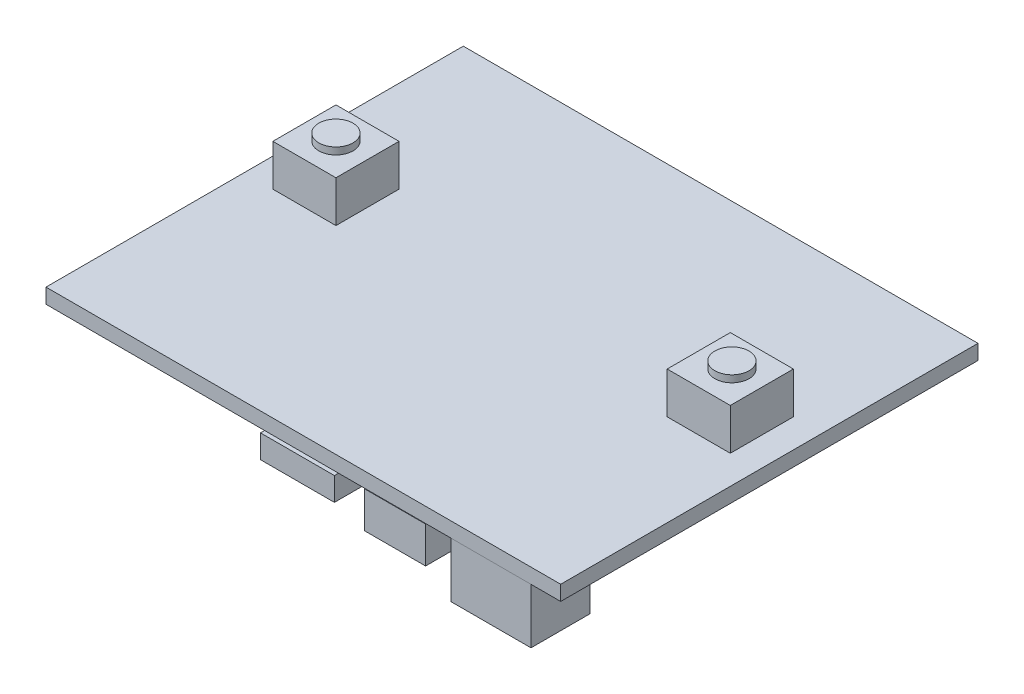
ISO-10303-21;
HEADER;
FILE_DESCRIPTION(('STEP AP214'),'2;1');
FILE_NAME('part.step','',(''),(''),'','','');
FILE_SCHEMA(('AUTOMOTIVE_DESIGN { 1 0 10303 214 1 1 1 1 }'));
ENDSEC;
DATA;
#1=APPLICATION_CONTEXT('core data for automotive mechanical design processes');
#2=APPLICATION_PROTOCOL_DEFINITION('international standard','automotive_design',2000,#1);
#3=PRODUCT_CONTEXT('',#1,'mechanical');
#4=PRODUCT('Part','Part','',(#3));
#5=PRODUCT_RELATED_PRODUCT_CATEGORY('part','',(#4));
#6=PRODUCT_DEFINITION_FORMATION('','',#4);
#7=PRODUCT_DEFINITION_CONTEXT('part definition',#1,'design');
#8=PRODUCT_DEFINITION('design','',#6,#7);
#9=PRODUCT_DEFINITION_SHAPE('','',#8);
#10=(LENGTH_UNIT() NAMED_UNIT(*) SI_UNIT(.MILLI.,.METRE.));
#11=(NAMED_UNIT(*) PLANE_ANGLE_UNIT() SI_UNIT($,.RADIAN.));
#12=(NAMED_UNIT(*) SI_UNIT($,.STERADIAN.) SOLID_ANGLE_UNIT());
#13=UNCERTAINTY_MEASURE_WITH_UNIT(LENGTH_MEASURE(1.E-05),#10,'distance_accuracy_value','');
#14=(GEOMETRIC_REPRESENTATION_CONTEXT(3) GLOBAL_UNCERTAINTY_ASSIGNED_CONTEXT((#13)) GLOBAL_UNIT_ASSIGNED_CONTEXT((#10,
#11,#12)) REPRESENTATION_CONTEXT('',''));
#15=CARTESIAN_POINT('',(0.,0.,0.));
#16=DIRECTION('',(0.,0.,1.));
#17=DIRECTION('',(1.,0.,0.));
#18=AXIS2_PLACEMENT_3D('',#15,#16,#17);
#19=CARTESIAN_POINT('',(0.,-1.5,0.));
#20=DIRECTION('',(0.,1.,0.));
#21=DIRECTION('',(0.,0.,1.));
#22=AXIS2_PLACEMENT_3D('',#19,#20,#21);
#23=PLANE('',#22);
#24=DIRECTION('',(0.,0.,-1.));
#25=VECTOR('',#24,1.);
#26=CARTESIAN_POINT('',(22.,-1.5,0.413325719228903));
#27=LINE('',#26,#25);
#28=CARTESIAN_POINT('',(22.,-1.5,0.));
#29=VERTEX_POINT('',#28);
#30=CARTESIAN_POINT('',(22.,-1.5,-5.4866742807711));
#31=VERTEX_POINT('',#30);
#32=EDGE_CURVE('E235',#29,#31,#27,.T.);
#33=ORIENTED_EDGE('',*,*,#32,.F.);
#34=DIRECTION('',(1.,0.,0.));
#35=VECTOR('',#34,1.);
#36=CARTESIAN_POINT('',(0.,-1.5,0.));
#37=LINE('',#36,#35);
#38=CARTESIAN_POINT('',(0.,-1.5,0.));
#39=VERTEX_POINT('',#38);
#40=EDGE_CURVE('E377',#39,#29,#37,.T.);
#41=ORIENTED_EDGE('',*,*,#40,.F.);
#42=DIRECTION('',(0.,0.,-1.));
#43=VECTOR('',#42,1.);
#44=CARTESIAN_POINT('',(0.,-1.5,0.));
#45=LINE('',#44,#43);
#46=CARTESIAN_POINT('',(0.,-1.5,-42.));
#47=VERTEX_POINT('',#46);
#48=EDGE_CURVE('E388',#39,#47,#45,.T.);
#49=ORIENTED_EDGE('',*,*,#48,.T.);
#50=DIRECTION('',(1.,0.,0.));
#51=VECTOR('',#50,1.);
#52=CARTESIAN_POINT('',(0.,-1.5,-42.));
#53=LINE('',#52,#51);
#54=CARTESIAN_POINT('',(51.8,-1.5,-42.));
#55=VERTEX_POINT('',#54);
#56=EDGE_CURVE('E386',#47,#55,#53,.T.);
#57=ORIENTED_EDGE('',*,*,#56,.T.);
#58=DIRECTION('',(0.,0.,-1.));
#59=VECTOR('',#58,1.);
#60=CARTESIAN_POINT('',(51.8,-1.5,0.));
#61=LINE('',#60,#59);
#62=CARTESIAN_POINT('',(51.8,-1.5,0.));
#63=VERTEX_POINT('',#62);
#64=EDGE_CURVE('E380',#63,#55,#61,.T.);
#65=ORIENTED_EDGE('',*,*,#64,.F.);
#66=CARTESIAN_POINT('',(38.2546903246862,-1.5,0.));
#67=VERTEX_POINT('',#66);
#68=EDGE_CURVE('E400',#67,#63,#37,.T.);
#69=ORIENTED_EDGE('',*,*,#68,.F.);
#70=DIRECTION('',(0.,0.,1.));
#71=VECTOR('',#70,1.);
#72=CARTESIAN_POINT('',(38.2546903246862,-1.5,-6.10873506961859));
#73=LINE('',#72,#71);
#74=CARTESIAN_POINT('',(38.2546903246862,-1.5,-6.10873506961859));
#75=VERTEX_POINT('',#74);
#76=EDGE_CURVE('E290',#75,#67,#73,.T.);
#77=ORIENTED_EDGE('',*,*,#76,.F.);
#78=DIRECTION('',(1.,0.,0.));
#79=VECTOR('',#78,1.);
#80=CARTESIAN_POINT('',(32.0946903246862,-1.5,-6.10873506961859));
#81=LINE('',#80,#79);
#82=CARTESIAN_POINT('',(32.0946903246862,-1.5,-6.10873506961859));
#83=VERTEX_POINT('',#82);
#84=EDGE_CURVE('E286',#83,#75,#81,.T.);
#85=ORIENTED_EDGE('',*,*,#84,.F.);
#86=DIRECTION('',(0.,0.,-1.));
#87=VECTOR('',#86,1.);
#88=CARTESIAN_POINT('',(32.0946903246862,-1.5,-6.10873506961859));
#89=LINE('',#88,#87);
#90=CARTESIAN_POINT('',(32.0946903246862,-1.5,0.));
#91=VERTEX_POINT('',#90);
#92=EDGE_CURVE('E48',#91,#83,#89,.T.);
#93=ORIENTED_EDGE('',*,*,#92,.F.);
#94=CARTESIAN_POINT('',(29.44,-1.5,0.));
#95=VERTEX_POINT('',#94);
#96=EDGE_CURVE('E382',#95,#91,#37,.T.);
#97=ORIENTED_EDGE('',*,*,#96,.F.);
#98=DIRECTION('',(0.,0.,1.));
#99=VECTOR('',#98,1.);
#100=CARTESIAN_POINT('',(29.44,-1.5,0.413325719228903));
#101=LINE('',#100,#99);
#102=CARTESIAN_POINT('',(29.44,-1.5,-5.4866742807711));
#103=VERTEX_POINT('',#102);
#104=EDGE_CURVE('E258',#103,#95,#101,.T.);
#105=ORIENTED_EDGE('',*,*,#104,.F.);
#106=DIRECTION('',(1.,0.,0.));
#107=VECTOR('',#106,1.);
#108=CARTESIAN_POINT('',(22.,-1.5,-5.4866742807711));
#109=LINE('',#108,#107);
#110=EDGE_CURVE('E255',#31,#103,#109,.T.);
#111=ORIENTED_EDGE('',*,*,#110,.F.);
#112=EDGE_LOOP('',(#33,#41,#49,#57,#65,#69,#77,#85,#93,#97,#105,#111));
#113=FACE_BOUND('',#112,.T.);
#114=DIRECTION('',(0.,0.,1.));
#115=VECTOR('',#114,1.);
#116=CARTESIAN_POINT('',(48.8,-1.5,-5.93123898902901));
#117=LINE('',#116,#115);
#118=CARTESIAN_POINT('',(48.8,-1.5,-5.93123898902901));
#119=VERTEX_POINT('',#118);
#120=CARTESIAN_POINT('',(48.8,-1.5,-0.0112389890290134));
#121=VERTEX_POINT('',#120);
#122=EDGE_CURVE('E234',#119,#121,#117,.T.);
#123=ORIENTED_EDGE('',*,*,#122,.F.);
#124=DIRECTION('',(1.,0.,0.));
#125=VECTOR('',#124,1.);
#126=CARTESIAN_POINT('',(48.8,-1.5,-5.93123898902901));
#127=LINE('',#126,#125);
#128=CARTESIAN_POINT('',(40.76,-1.5,-5.93123898902901));
#129=VERTEX_POINT('',#128);
#130=EDGE_CURVE('E231',#129,#119,#127,.T.);
#131=ORIENTED_EDGE('',*,*,#130,.F.);
#132=DIRECTION('',(0.,0.,-1.));
#133=VECTOR('',#132,1.);
#134=CARTESIAN_POINT('',(40.76,-1.5,-5.93123898902901));
#135=LINE('',#134,#133);
#136=CARTESIAN_POINT('',(40.76,-1.5,-0.0112389890290144));
#137=VERTEX_POINT('',#136);
#138=EDGE_CURVE('E61',#137,#129,#135,.T.);
#139=ORIENTED_EDGE('',*,*,#138,.F.);
#140=DIRECTION('',(-1.,0.,0.));
#141=VECTOR('',#140,1.);
#142=CARTESIAN_POINT('',(48.8,-1.5,-0.0112389890290134));
#143=LINE('',#142,#141);
#144=EDGE_CURVE('E56',#121,#137,#143,.T.);
#145=ORIENTED_EDGE('',*,*,#144,.F.);
#146=EDGE_LOOP('',(#123,#131,#139,#145));
#147=FACE_BOUND('',#146,.T.);
#148=ADVANCED_FACE('F39',(#113,#147),#23,.F.);
#149=CARTESIAN_POINT('',(0.,0.,0.));
#150=DIRECTION('',(0.,1.,0.));
#151=DIRECTION('',(0.,0.,1.));
#152=AXIS2_PLACEMENT_3D('',#149,#150,#151);
#153=PLANE('',#152);
#154=DIRECTION('',(1.,0.,0.));
#155=VECTOR('',#154,1.);
#156=CARTESIAN_POINT('',(0.,0.,0.));
#157=LINE('',#156,#155);
#158=CARTESIAN_POINT('',(0.,0.,0.));
#159=VERTEX_POINT('',#158);
#160=CARTESIAN_POINT('',(51.8,0.,0.));
#161=VERTEX_POINT('',#160);
#162=EDGE_CURVE('E349',#159,#161,#157,.T.);
#163=ORIENTED_EDGE('',*,*,#162,.T.);
#164=DIRECTION('',(0.,0.,-1.));
#165=VECTOR('',#164,1.);
#166=CARTESIAN_POINT('',(51.8,0.,0.));
#167=LINE('',#166,#165);
#168=CARTESIAN_POINT('',(51.8,0.,-42.));
#169=VERTEX_POINT('',#168);
#170=EDGE_CURVE('E392',#161,#169,#167,.T.);
#171=ORIENTED_EDGE('',*,*,#170,.T.);
#172=DIRECTION('',(1.,0.,0.));
#173=VECTOR('',#172,1.);
#174=CARTESIAN_POINT('',(0.,0.,-42.));
#175=LINE('',#174,#173);
#176=CARTESIAN_POINT('',(0.,0.,-42.));
#177=VERTEX_POINT('',#176);
#178=EDGE_CURVE('E395',#177,#169,#175,.T.);
#179=ORIENTED_EDGE('',*,*,#178,.F.);
#180=DIRECTION('',(0.,0.,-1.));
#181=VECTOR('',#180,1.);
#182=CARTESIAN_POINT('',(0.,0.,0.));
#183=LINE('',#182,#181);
#184=EDGE_CURVE('E398',#159,#177,#183,.T.);
#185=ORIENTED_EDGE('',*,*,#184,.F.);
#186=EDGE_LOOP('',(#163,#171,#179,#185));
#187=FACE_BOUND('',#186,.T.);
#188=DIRECTION('',(1.,0.,0.));
#189=VECTOR('',#188,1.);
#190=CARTESIAN_POINT('',(42.57,0.,-19.95));
#191=LINE('',#190,#189);
#192=CARTESIAN_POINT('',(42.57,0.,-19.95));
#193=VERTEX_POINT('',#192);
#194=CARTESIAN_POINT('',(48.92,0.,-19.95));
#195=VERTEX_POINT('',#194);
#196=EDGE_CURVE('E366',#193,#195,#191,.T.);
#197=ORIENTED_EDGE('',*,*,#196,.F.);
#198=DIRECTION('',(0.,0.,1.));
#199=VECTOR('',#198,1.);
#200=CARTESIAN_POINT('',(42.57,0.,-26.3));
#201=LINE('',#200,#199);
#202=CARTESIAN_POINT('',(42.57,0.,-26.3));
#203=VERTEX_POINT('',#202);
#204=EDGE_CURVE('E334',#203,#193,#201,.T.);
#205=ORIENTED_EDGE('',*,*,#204,.F.);
#206=DIRECTION('',(-1.,0.,0.));
#207=VECTOR('',#206,1.);
#208=CARTESIAN_POINT('',(42.57,0.,-26.3));
#209=LINE('',#208,#207);
#210=CARTESIAN_POINT('',(48.92,0.,-26.3));
#211=VERTEX_POINT('',#210);
#212=EDGE_CURVE('E360',#211,#203,#209,.T.);
#213=ORIENTED_EDGE('',*,*,#212,.F.);
#214=DIRECTION('',(0.,0.,-1.));
#215=VECTOR('',#214,1.);
#216=CARTESIAN_POINT('',(48.92,0.,-26.3));
#217=LINE('',#216,#215);
#218=EDGE_CURVE('E362',#195,#211,#217,.T.);
#219=ORIENTED_EDGE('',*,*,#218,.F.);
#220=EDGE_LOOP('',(#197,#205,#213,#219));
#221=FACE_BOUND('',#220,.T.);
#222=DIRECTION('',(1.,0.,0.));
#223=VECTOR('',#222,1.);
#224=CARTESIAN_POINT('',(2.88,0.,-19.95));
#225=LINE('',#224,#223);
#226=CARTESIAN_POINT('',(2.88,0.,-19.95));
#227=VERTEX_POINT('',#226);
#228=CARTESIAN_POINT('',(9.23,0.,-19.95));
#229=VERTEX_POINT('',#228);
#230=EDGE_CURVE('E333',#227,#229,#225,.T.);
#231=ORIENTED_EDGE('',*,*,#230,.F.);
#232=DIRECTION('',(0.,0.,1.));
#233=VECTOR('',#232,1.);
#234=CARTESIAN_POINT('',(2.88,0.,-26.3));
#235=LINE('',#234,#233);
#236=CARTESIAN_POINT('',(2.88,0.,-26.3));
#237=VERTEX_POINT('',#236);
#238=EDGE_CURVE('E330',#237,#227,#235,.T.);
#239=ORIENTED_EDGE('',*,*,#238,.F.);
#240=DIRECTION('',(-1.,0.,0.));
#241=VECTOR('',#240,1.);
#242=CARTESIAN_POINT('',(2.88,0.,-26.3));
#243=LINE('',#242,#241);
#244=CARTESIAN_POINT('',(9.23,0.,-26.3));
#245=VERTEX_POINT('',#244);
#246=EDGE_CURVE('E323',#245,#237,#243,.T.);
#247=ORIENTED_EDGE('',*,*,#246,.F.);
#248=DIRECTION('',(0.,0.,-1.));
#249=VECTOR('',#248,1.);
#250=CARTESIAN_POINT('',(9.23,0.,-26.3));
#251=LINE('',#250,#249);
#252=EDGE_CURVE('E336',#229,#245,#251,.T.);
#253=ORIENTED_EDGE('',*,*,#252,.F.);
#254=EDGE_LOOP('',(#231,#239,#247,#253));
#255=FACE_BOUND('',#254,.T.);
#256=ADVANCED_FACE('F417',(#187,#221,#255),#153,.T.);
#257=CARTESIAN_POINT('',(0.,-1.5,0.));
#258=DIRECTION('',(0.,0.,1.));
#259=DIRECTION('',(1.,0.,0.));
#260=AXIS2_PLACEMENT_3D('',#257,#258,#259);
#261=PLANE('',#260);
#262=ORIENTED_EDGE('',*,*,#162,.F.);
#263=DIRECTION('',(0.,1.,0.));
#264=VECTOR('',#263,1.);
#265=CARTESIAN_POINT('',(0.,-1.5,0.));
#266=LINE('',#265,#264);
#267=EDGE_CURVE('E314',#39,#159,#266,.T.);
#268=ORIENTED_EDGE('',*,*,#267,.F.);
#269=ORIENTED_EDGE('',*,*,#40,.T.);
#270=EDGE_CURVE('E381',#29,#95,#37,.T.);
#271=ORIENTED_EDGE('',*,*,#270,.T.);
#272=ORIENTED_EDGE('',*,*,#96,.T.);
#273=EDGE_CURVE('E383',#91,#67,#37,.T.);
#274=ORIENTED_EDGE('',*,*,#273,.T.);
#275=ORIENTED_EDGE('',*,*,#68,.T.);
#276=DIRECTION('',(0.,1.,0.));
#277=VECTOR('',#276,1.);
#278=CARTESIAN_POINT('',(51.8,-1.5,0.));
#279=LINE('',#278,#277);
#280=EDGE_CURVE('E43',#63,#161,#279,.T.);
#281=ORIENTED_EDGE('',*,*,#280,.T.);
#282=EDGE_LOOP('',(#262,#268,#269,#271,#272,#274,#275,#281));
#283=FACE_BOUND('',#282,.T.);
#284=ADVANCED_FACE('F41',(#283),#261,.T.);
#285=CARTESIAN_POINT('',(0.,-1.5,0.));
#286=DIRECTION('',(1.,0.,0.));
#287=DIRECTION('',(0.,0.,-1.));
#288=AXIS2_PLACEMENT_3D('',#285,#286,#287);
#289=PLANE('',#288);
#290=ORIENTED_EDGE('',*,*,#184,.T.);
#291=DIRECTION('',(0.,1.,0.));
#292=VECTOR('',#291,1.);
#293=CARTESIAN_POINT('',(0.,-1.5,-42.));
#294=LINE('',#293,#292);
#295=EDGE_CURVE('E402',#47,#177,#294,.T.);
#296=ORIENTED_EDGE('',*,*,#295,.F.);
#297=ORIENTED_EDGE('',*,*,#48,.F.);
#298=ORIENTED_EDGE('',*,*,#267,.T.);
#299=EDGE_LOOP('',(#290,#296,#297,#298));
#300=FACE_BOUND('',#299,.T.);
#301=ADVANCED_FACE('F421',(#300),#289,.F.);
#302=CARTESIAN_POINT('',(0.,-1.5,-42.));
#303=DIRECTION('',(0.,0.,1.));
#304=DIRECTION('',(1.,0.,0.));
#305=AXIS2_PLACEMENT_3D('',#302,#303,#304);
#306=PLANE('',#305);
#307=ORIENTED_EDGE('',*,*,#178,.T.);
#308=DIRECTION('',(0.,1.,0.));
#309=VECTOR('',#308,1.);
#310=CARTESIAN_POINT('',(51.8,-1.5,-42.));
#311=LINE('',#310,#309);
#312=EDGE_CURVE('E404',#55,#169,#311,.T.);
#313=ORIENTED_EDGE('',*,*,#312,.F.);
#314=ORIENTED_EDGE('',*,*,#56,.F.);
#315=ORIENTED_EDGE('',*,*,#295,.T.);
#316=EDGE_LOOP('',(#307,#313,#314,#315));
#317=FACE_BOUND('',#316,.T.);
#318=ADVANCED_FACE('F425',(#317),#306,.F.);
#319=CARTESIAN_POINT('',(51.8,-1.5,0.));
#320=DIRECTION('',(1.,0.,0.));
#321=DIRECTION('',(0.,0.,-1.));
#322=AXIS2_PLACEMENT_3D('',#319,#320,#321);
#323=PLANE('',#322);
#324=ORIENTED_EDGE('',*,*,#170,.F.);
#325=ORIENTED_EDGE('',*,*,#280,.F.);
#326=ORIENTED_EDGE('',*,*,#64,.T.);
#327=ORIENTED_EDGE('',*,*,#312,.T.);
#328=EDGE_LOOP('',(#324,#325,#326,#327));
#329=FACE_BOUND('',#328,.T.);
#330=ADVANCED_FACE('F413',(#329),#323,.T.);
#331=CARTESIAN_POINT('',(42.57,4.17,-26.3));
#332=DIRECTION('',(1.,0.,0.));
#333=DIRECTION('',(0.,0.,-1.));
#334=AXIS2_PLACEMENT_3D('',#331,#332,#333);
#335=PLANE('',#334);
#336=ORIENTED_EDGE('',*,*,#204,.T.);
#337=DIRECTION('',(0.,-1.,0.));
#338=VECTOR('',#337,1.);
#339=CARTESIAN_POINT('',(42.57,4.17,-19.95));
#340=LINE('',#339,#338);
#341=CARTESIAN_POINT('',(42.57,4.17,-19.95));
#342=VERTEX_POINT('',#341);
#343=EDGE_CURVE('E309',#342,#193,#340,.T.);
#344=ORIENTED_EDGE('',*,*,#343,.F.);
#345=DIRECTION('',(0.,0.,1.));
#346=VECTOR('',#345,1.);
#347=CARTESIAN_POINT('',(42.57,4.17,-26.3));
#348=LINE('',#347,#346);
#349=CARTESIAN_POINT('',(42.57,4.17,-26.3));
#350=VERTEX_POINT('',#349);
#351=EDGE_CURVE('E363',#350,#342,#348,.T.);
#352=ORIENTED_EDGE('',*,*,#351,.F.);
#353=DIRECTION('',(0.,-1.,0.));
#354=VECTOR('',#353,1.);
#355=CARTESIAN_POINT('',(42.57,4.17,-26.3));
#356=LINE('',#355,#354);
#357=EDGE_CURVE('E356',#350,#203,#356,.T.);
#358=ORIENTED_EDGE('',*,*,#357,.T.);
#359=EDGE_LOOP('',(#336,#344,#352,#358));
#360=FACE_BOUND('',#359,.T.);
#361=ADVANCED_FACE('F499',(#360),#335,.F.);
#362=CARTESIAN_POINT('',(42.57,4.17,-19.95));
#363=DIRECTION('',(0.,0.,-1.));
#364=DIRECTION('',(-1.,0.,0.));
#365=AXIS2_PLACEMENT_3D('',#362,#363,#364);
#366=PLANE('',#365);
#367=ORIENTED_EDGE('',*,*,#196,.T.);
#368=DIRECTION('',(0.,-1.,0.));
#369=VECTOR('',#368,1.);
#370=CARTESIAN_POINT('',(48.92,4.17,-19.95));
#371=LINE('',#370,#369);
#372=CARTESIAN_POINT('',(48.92,4.17,-19.95));
#373=VERTEX_POINT('',#372);
#374=EDGE_CURVE('E351',#373,#195,#371,.T.);
#375=ORIENTED_EDGE('',*,*,#374,.F.);
#376=DIRECTION('',(1.,0.,0.));
#377=VECTOR('',#376,1.);
#378=CARTESIAN_POINT('',(42.57,4.17,-19.95));
#379=LINE('',#378,#377);
#380=EDGE_CURVE('E373',#342,#373,#379,.T.);
#381=ORIENTED_EDGE('',*,*,#380,.F.);
#382=ORIENTED_EDGE('',*,*,#343,.T.);
#383=EDGE_LOOP('',(#367,#375,#381,#382));
#384=FACE_BOUND('',#383,.T.);
#385=ADVANCED_FACE('F503',(#384),#366,.F.);
#386=CARTESIAN_POINT('',(48.92,4.17,-26.3));
#387=DIRECTION('',(-1.,0.,0.));
#388=DIRECTION('',(0.,0.,1.));
#389=AXIS2_PLACEMENT_3D('',#386,#387,#388);
#390=PLANE('',#389);
#391=ORIENTED_EDGE('',*,*,#218,.T.);
#392=DIRECTION('',(0.,-1.,0.));
#393=VECTOR('',#392,1.);
#394=CARTESIAN_POINT('',(48.92,4.17,-26.3));
#395=LINE('',#394,#393);
#396=CARTESIAN_POINT('',(48.92,4.17,-26.3));
#397=VERTEX_POINT('',#396);
#398=EDGE_CURVE('E354',#397,#211,#395,.T.);
#399=ORIENTED_EDGE('',*,*,#398,.F.);
#400=DIRECTION('',(0.,0.,-1.));
#401=VECTOR('',#400,1.);
#402=CARTESIAN_POINT('',(48.92,4.17,-26.3));
#403=LINE('',#402,#401);
#404=EDGE_CURVE('E371',#373,#397,#403,.T.);
#405=ORIENTED_EDGE('',*,*,#404,.F.);
#406=ORIENTED_EDGE('',*,*,#374,.T.);
#407=EDGE_LOOP('',(#391,#399,#405,#406));
#408=FACE_BOUND('',#407,.T.);
#409=ADVANCED_FACE('F509',(#408),#390,.F.);
#410=CARTESIAN_POINT('',(42.57,4.17,-26.3));
#411=DIRECTION('',(0.,0.,1.));
#412=DIRECTION('',(1.,0.,0.));
#413=AXIS2_PLACEMENT_3D('',#410,#411,#412);
#414=PLANE('',#413);
#415=ORIENTED_EDGE('',*,*,#212,.T.);
#416=ORIENTED_EDGE('',*,*,#357,.F.);
#417=DIRECTION('',(-1.,0.,0.));
#418=VECTOR('',#417,1.);
#419=CARTESIAN_POINT('',(42.57,4.17,-26.3));
#420=LINE('',#419,#418);
#421=EDGE_CURVE('E359',#397,#350,#420,.T.);
#422=ORIENTED_EDGE('',*,*,#421,.F.);
#423=ORIENTED_EDGE('',*,*,#398,.T.);
#424=EDGE_LOOP('',(#415,#416,#422,#423));
#425=FACE_BOUND('',#424,.T.);
#426=ADVANCED_FACE('F517',(#425),#414,.F.);
#427=CARTESIAN_POINT('',(0.,4.17,0.));
#428=DIRECTION('',(0.,1.,0.));
#429=DIRECTION('',(0.,0.,1.));
#430=AXIS2_PLACEMENT_3D('',#427,#428,#429);
#431=PLANE('',#430);
#432=CARTESIAN_POINT('',(45.8170140740058,4.17,-23.2178731345387));
#433=DIRECTION('',(0.,1.,0.));
#434=DIRECTION('',(0.,0.,1.));
#435=AXIS2_PLACEMENT_3D('',#432,#433,#434);
#436=CIRCLE('',#435,1.72000000000001);
#437=CARTESIAN_POINT('',(45.8170140740058,4.17,-21.4978731345387));
#438=VERTEX_POINT('',#437);
#439=EDGE_CURVE('E313',#438,#438,#436,.T.);
#440=ORIENTED_EDGE('',*,*,#439,.F.);
#441=EDGE_LOOP('',(#440));
#442=FACE_BOUND('',#441,.T.);
#443=ORIENTED_EDGE('',*,*,#351,.T.);
#444=ORIENTED_EDGE('',*,*,#380,.T.);
#445=ORIENTED_EDGE('',*,*,#404,.T.);
#446=ORIENTED_EDGE('',*,*,#421,.T.);
#447=EDGE_LOOP('',(#443,#444,#445,#446));
#448=FACE_BOUND('',#447,.T.);
#449=ADVANCED_FACE('F492',(#442,#448),#431,.T.);
#450=CARTESIAN_POINT('',(2.88,4.17,-26.3));
#451=DIRECTION('',(1.,0.,0.));
#452=DIRECTION('',(0.,0.,-1.));
#453=AXIS2_PLACEMENT_3D('',#450,#451,#452);
#454=PLANE('',#453);
#455=ORIENTED_EDGE('',*,*,#238,.T.);
#456=DIRECTION('',(0.,-1.,0.));
#457=VECTOR('',#456,1.);
#458=CARTESIAN_POINT('',(2.88,4.17,-19.95));
#459=LINE('',#458,#457);
#460=CARTESIAN_POINT('',(2.88,4.17,-19.95));
#461=VERTEX_POINT('',#460);
#462=EDGE_CURVE('E347',#461,#227,#459,.T.);
#463=ORIENTED_EDGE('',*,*,#462,.F.);
#464=DIRECTION('',(0.,0.,1.));
#465=VECTOR('',#464,1.);
#466=CARTESIAN_POINT('',(2.88,4.17,-26.3));
#467=LINE('',#466,#465);
#468=CARTESIAN_POINT('',(2.88,4.17,-26.3));
#469=VERTEX_POINT('',#468);
#470=EDGE_CURVE('E319',#469,#461,#467,.T.);
#471=ORIENTED_EDGE('',*,*,#470,.F.);
#472=DIRECTION('',(0.,-1.,0.));
#473=VECTOR('',#472,1.);
#474=CARTESIAN_POINT('',(2.88,4.17,-26.3));
#475=LINE('',#474,#473);
#476=EDGE_CURVE('E329',#469,#237,#475,.T.);
#477=ORIENTED_EDGE('',*,*,#476,.T.);
#478=EDGE_LOOP('',(#455,#463,#471,#477));
#479=FACE_BOUND('',#478,.T.);
#480=ADVANCED_FACE('F513',(#479),#454,.F.);
#481=CARTESIAN_POINT('',(2.88,4.17,-19.95));
#482=DIRECTION('',(0.,0.,-1.));
#483=DIRECTION('',(-1.,0.,0.));
#484=AXIS2_PLACEMENT_3D('',#481,#482,#483);
#485=PLANE('',#484);
#486=ORIENTED_EDGE('',*,*,#230,.T.);
#487=DIRECTION('',(0.,-1.,0.));
#488=VECTOR('',#487,1.);
#489=CARTESIAN_POINT('',(9.23,4.17,-19.95));
#490=LINE('',#489,#488);
#491=CARTESIAN_POINT('',(9.23,4.17,-19.95));
#492=VERTEX_POINT('',#491);
#493=EDGE_CURVE('E344',#492,#229,#490,.T.);
#494=ORIENTED_EDGE('',*,*,#493,.F.);
#495=DIRECTION('',(1.,0.,0.));
#496=VECTOR('',#495,1.);
#497=CARTESIAN_POINT('',(2.88,4.17,-19.95));
#498=LINE('',#497,#496);
#499=EDGE_CURVE('E322',#461,#492,#498,.T.);
#500=ORIENTED_EDGE('',*,*,#499,.F.);
#501=ORIENTED_EDGE('',*,*,#462,.T.);
#502=EDGE_LOOP('',(#486,#494,#500,#501));
#503=FACE_BOUND('',#502,.T.);
#504=ADVANCED_FACE('F545',(#503),#485,.F.);
#505=CARTESIAN_POINT('',(9.23,4.17,-26.3));
#506=DIRECTION('',(-1.,0.,0.));
#507=DIRECTION('',(0.,0.,1.));
#508=AXIS2_PLACEMENT_3D('',#505,#506,#507);
#509=PLANE('',#508);
#510=ORIENTED_EDGE('',*,*,#252,.T.);
#511=DIRECTION('',(0.,-1.,0.));
#512=VECTOR('',#511,1.);
#513=CARTESIAN_POINT('',(9.23,4.17,-26.3));
#514=LINE('',#513,#512);
#515=CARTESIAN_POINT('',(9.23,4.17,-26.3));
#516=VERTEX_POINT('',#515);
#517=EDGE_CURVE('E342',#516,#245,#514,.T.);
#518=ORIENTED_EDGE('',*,*,#517,.F.);
#519=DIRECTION('',(0.,0.,-1.));
#520=VECTOR('',#519,1.);
#521=CARTESIAN_POINT('',(9.23,4.17,-26.3));
#522=LINE('',#521,#520);
#523=EDGE_CURVE('E325',#492,#516,#522,.T.);
#524=ORIENTED_EDGE('',*,*,#523,.F.);
#525=ORIENTED_EDGE('',*,*,#493,.T.);
#526=EDGE_LOOP('',(#510,#518,#524,#525));
#527=FACE_BOUND('',#526,.T.);
#528=ADVANCED_FACE('F549',(#527),#509,.F.);
#529=CARTESIAN_POINT('',(2.88,4.17,-26.3));
#530=DIRECTION('',(0.,0.,1.));
#531=DIRECTION('',(1.,0.,0.));
#532=AXIS2_PLACEMENT_3D('',#529,#530,#531);
#533=PLANE('',#532);
#534=ORIENTED_EDGE('',*,*,#246,.T.);
#535=ORIENTED_EDGE('',*,*,#476,.F.);
#536=DIRECTION('',(-1.,0.,0.));
#537=VECTOR('',#536,1.);
#538=CARTESIAN_POINT('',(2.88,4.17,-26.3));
#539=LINE('',#538,#537);
#540=EDGE_CURVE('E327',#516,#469,#539,.T.);
#541=ORIENTED_EDGE('',*,*,#540,.F.);
#542=ORIENTED_EDGE('',*,*,#517,.T.);
#543=EDGE_LOOP('',(#534,#535,#541,#542));
#544=FACE_BOUND('',#543,.T.);
#545=ADVANCED_FACE('F558',(#544),#533,.F.);
#546=CARTESIAN_POINT('',(0.,4.17,0.));
#547=DIRECTION('',(0.,1.,0.));
#548=DIRECTION('',(0.,0.,1.));
#549=AXIS2_PLACEMENT_3D('',#546,#547,#548);
#550=PLANE('',#549);
#551=CARTESIAN_POINT('',(6.03053014854837,4.17,-23.1489454574891));
#552=DIRECTION('',(0.,1.,0.));
#553=DIRECTION('',(0.,0.,1.));
#554=AXIS2_PLACEMENT_3D('',#551,#552,#553);
#555=CIRCLE('',#554,1.72);
#556=CARTESIAN_POINT('',(6.03053014854837,4.17,-21.4289454574891));
#557=VERTEX_POINT('',#556);
#558=EDGE_CURVE('E310',#557,#557,#555,.T.);
#559=ORIENTED_EDGE('',*,*,#558,.F.);
#560=EDGE_LOOP('',(#559));
#561=FACE_BOUND('',#560,.T.);
#562=ORIENTED_EDGE('',*,*,#470,.T.);
#563=ORIENTED_EDGE('',*,*,#499,.T.);
#564=ORIENTED_EDGE('',*,*,#523,.T.);
#565=ORIENTED_EDGE('',*,*,#540,.T.);
#566=EDGE_LOOP('',(#562,#563,#564,#565));
#567=FACE_BOUND('',#566,.T.);
#568=ADVANCED_FACE('F553',(#561,#567),#550,.T.);
#569=CARTESIAN_POINT('',(6.03053014854837,4.87,-23.1489454574891));
#570=DIRECTION('',(0.,-1.,0.));
#571=DIRECTION('',(0.,0.,-1.));
#572=AXIS2_PLACEMENT_3D('',#569,#570,#571);
#573=CYLINDRICAL_SURFACE('',#572,1.72);
#574=CARTESIAN_POINT('',(6.03053014854837,4.87,-23.1489454574891));
#575=DIRECTION('',(0.,1.,0.));
#576=DIRECTION('',(0.,0.,1.));
#577=AXIS2_PLACEMENT_3D('',#574,#575,#576);
#578=CIRCLE('',#577,1.72);
#579=CARTESIAN_POINT('',(6.03053014854837,4.87,-21.4289454574891));
#580=VERTEX_POINT('',#579);
#581=EDGE_CURVE('E306',#580,#580,#578,.T.);
#582=ORIENTED_EDGE('',*,*,#581,.F.);
#583=EDGE_LOOP('',(#582));
#584=FACE_BOUND('',#583,.T.);
#585=ORIENTED_EDGE('',*,*,#558,.T.);
#586=EDGE_LOOP('',(#585));
#587=FACE_BOUND('',#586,.T.);
#588=ADVANCED_FACE('F565',(#584,#587),#573,.T.);
#589=CARTESIAN_POINT('',(6.03053014854837,4.87,-23.1489454574891));
#590=DIRECTION('',(0.,1.,0.));
#591=DIRECTION('',(0.,0.,1.));
#592=AXIS2_PLACEMENT_3D('',#589,#590,#591);
#593=PLANE('',#592);
#594=ORIENTED_EDGE('',*,*,#581,.T.);
#595=EDGE_LOOP('',(#594));
#596=FACE_BOUND('',#595,.T.);
#597=ADVANCED_FACE('F609',(#596),#593,.T.);
#598=CARTESIAN_POINT('',(45.8170140740058,4.87,-23.2178731345387));
#599=DIRECTION('',(0.,-1.,0.));
#600=DIRECTION('',(0.,0.,-1.));
#601=AXIS2_PLACEMENT_3D('',#598,#599,#600);
#602=CYLINDRICAL_SURFACE('',#601,1.72000000000001);
#603=CARTESIAN_POINT('',(45.8170140740058,4.87,-23.2178731345387));
#604=DIRECTION('',(0.,1.,0.));
#605=DIRECTION('',(0.,0.,1.));
#606=AXIS2_PLACEMENT_3D('',#603,#604,#605);
#607=CIRCLE('',#606,1.72000000000001);
#608=CARTESIAN_POINT('',(45.8170140740058,4.87,-21.4978731345387));
#609=VERTEX_POINT('',#608);
#610=EDGE_CURVE('E305',#609,#609,#607,.T.);
#611=ORIENTED_EDGE('',*,*,#610,.F.);
#612=EDGE_LOOP('',(#611));
#613=FACE_BOUND('',#612,.T.);
#614=ORIENTED_EDGE('',*,*,#439,.T.);
#615=EDGE_LOOP('',(#614));
#616=FACE_BOUND('',#615,.T.);
#617=ADVANCED_FACE('F619',(#613,#616),#602,.T.);
#618=CARTESIAN_POINT('',(45.8170140740058,4.87,-23.2178731345387));
#619=DIRECTION('',(0.,1.,0.));
#620=DIRECTION('',(0.,0.,1.));
#621=AXIS2_PLACEMENT_3D('',#618,#619,#620);
#622=PLANE('',#621);
#623=ORIENTED_EDGE('',*,*,#610,.T.);
#624=EDGE_LOOP('',(#623));
#625=FACE_BOUND('',#624,.T.);
#626=ADVANCED_FACE('F629',(#625),#622,.T.);
#627=CARTESIAN_POINT('',(0.,-1.5,0.));
#628=DIRECTION('',(0.,1.,0.));
#629=DIRECTION('',(0.,0.,1.));
#630=AXIS2_PLACEMENT_3D('',#627,#628,#629);
#631=PLANE('',#630);
#632=ORIENTED_EDGE('',*,*,#273,.F.);
#633=CARTESIAN_POINT('',(32.0946903246862,-1.5,0.0512649303814078));
#634=VERTEX_POINT('',#633);
#635=EDGE_CURVE('E272',#634,#91,#89,.T.);
#636=ORIENTED_EDGE('',*,*,#635,.F.);
#637=DIRECTION('',(-1.,0.,0.));
#638=VECTOR('',#637,1.);
#639=CARTESIAN_POINT('',(32.0946903246862,-1.5,0.0512649303814078));
#640=LINE('',#639,#638);
#641=CARTESIAN_POINT('',(38.2546903246862,-1.5,0.0512649303814078));
#642=VERTEX_POINT('',#641);
#643=EDGE_CURVE('E277',#642,#634,#640,.T.);
#644=ORIENTED_EDGE('',*,*,#643,.F.);
#645=EDGE_CURVE('E289',#67,#642,#73,.T.);
#646=ORIENTED_EDGE('',*,*,#645,.F.);
#647=EDGE_LOOP('',(#632,#636,#644,#646));
#648=FACE_BOUND('',#647,.T.);
#649=ADVANCED_FACE('F441',(#648),#631,.T.);
#650=CARTESIAN_POINT('',(32.0946903246862,-5.16,-6.10873506961859));
#651=DIRECTION('',(1.,0.,0.));
#652=DIRECTION('',(0.,0.,-1.));
#653=AXIS2_PLACEMENT_3D('',#650,#651,#652);
#654=PLANE('',#653);
#655=ORIENTED_EDGE('',*,*,#635,.T.);
#656=ORIENTED_EDGE('',*,*,#92,.T.);
#657=DIRECTION('',(0.,1.,0.));
#658=VECTOR('',#657,1.);
#659=CARTESIAN_POINT('',(32.0946903246862,-5.16,-6.10873506961859));
#660=LINE('',#659,#658);
#661=CARTESIAN_POINT('',(32.0946903246862,-5.16,-6.10873506961859));
#662=VERTEX_POINT('',#661);
#663=EDGE_CURVE('E302',#662,#83,#660,.T.);
#664=ORIENTED_EDGE('',*,*,#663,.F.);
#665=DIRECTION('',(0.,0.,-1.));
#666=VECTOR('',#665,1.);
#667=CARTESIAN_POINT('',(32.0946903246862,-5.16,-6.10873506961859));
#668=LINE('',#667,#666);
#669=CARTESIAN_POINT('',(32.0946903246862,-5.16,0.0512649303814078));
#670=VERTEX_POINT('',#669);
#671=EDGE_CURVE('E273',#670,#662,#668,.T.);
#672=ORIENTED_EDGE('',*,*,#671,.F.);
#673=DIRECTION('',(0.,1.,0.));
#674=VECTOR('',#673,1.);
#675=CARTESIAN_POINT('',(32.0946903246862,-5.16,0.0512649303814078));
#676=LINE('',#675,#674);
#677=EDGE_CURVE('E283',#670,#634,#676,.T.);
#678=ORIENTED_EDGE('',*,*,#677,.T.);
#679=EDGE_LOOP('',(#655,#656,#664,#672,#678));
#680=FACE_BOUND('',#679,.T.);
#681=ADVANCED_FACE('F453',(#680),#654,.F.);
#682=CARTESIAN_POINT('',(32.0946903246862,-5.16,-6.10873506961859));
#683=DIRECTION('',(0.,0.,1.));
#684=DIRECTION('',(1.,0.,0.));
#685=AXIS2_PLACEMENT_3D('',#682,#683,#684);
#686=PLANE('',#685);
#687=ORIENTED_EDGE('',*,*,#84,.T.);
#688=DIRECTION('',(0.,1.,0.));
#689=VECTOR('',#688,1.);
#690=CARTESIAN_POINT('',(38.2546903246862,-5.16,-6.10873506961859));
#691=LINE('',#690,#689);
#692=CARTESIAN_POINT('',(38.2546903246862,-5.16,-6.10873506961859));
#693=VERTEX_POINT('',#692);
#694=EDGE_CURVE('E299',#693,#75,#691,.T.);
#695=ORIENTED_EDGE('',*,*,#694,.F.);
#696=DIRECTION('',(1.,0.,0.));
#697=VECTOR('',#696,1.);
#698=CARTESIAN_POINT('',(32.0946903246862,-5.16,-6.10873506961859));
#699=LINE('',#698,#697);
#700=EDGE_CURVE('E276',#662,#693,#699,.T.);
#701=ORIENTED_EDGE('',*,*,#700,.F.);
#702=ORIENTED_EDGE('',*,*,#663,.T.);
#703=EDGE_LOOP('',(#687,#695,#701,#702));
#704=FACE_BOUND('',#703,.T.);
#705=ADVANCED_FACE('F449',(#704),#686,.F.);
#706=CARTESIAN_POINT('',(38.2546903246862,-5.16,-6.10873506961859));
#707=DIRECTION('',(-1.,0.,0.));
#708=DIRECTION('',(0.,0.,1.));
#709=AXIS2_PLACEMENT_3D('',#706,#707,#708);
#710=PLANE('',#709);
#711=ORIENTED_EDGE('',*,*,#76,.T.);
#712=ORIENTED_EDGE('',*,*,#645,.T.);
#713=DIRECTION('',(0.,1.,0.));
#714=VECTOR('',#713,1.);
#715=CARTESIAN_POINT('',(38.2546903246862,-5.16,0.0512649303814078));
#716=LINE('',#715,#714);
#717=CARTESIAN_POINT('',(38.2546903246862,-5.16,0.0512649303814078));
#718=VERTEX_POINT('',#717);
#719=EDGE_CURVE('E296',#718,#642,#716,.T.);
#720=ORIENTED_EDGE('',*,*,#719,.F.);
#721=DIRECTION('',(0.,0.,1.));
#722=VECTOR('',#721,1.);
#723=CARTESIAN_POINT('',(38.2546903246862,-5.16,-6.10873506961859));
#724=LINE('',#723,#722);
#725=EDGE_CURVE('E279',#693,#718,#724,.T.);
#726=ORIENTED_EDGE('',*,*,#725,.F.);
#727=ORIENTED_EDGE('',*,*,#694,.T.);
#728=EDGE_LOOP('',(#711,#712,#720,#726,#727));
#729=FACE_BOUND('',#728,.T.);
#730=ADVANCED_FACE('F444',(#729),#710,.F.);
#731=CARTESIAN_POINT('',(32.0946903246862,-5.16,0.0512649303814078));
#732=DIRECTION('',(0.,0.,-1.));
#733=DIRECTION('',(-1.,0.,0.));
#734=AXIS2_PLACEMENT_3D('',#731,#732,#733);
#735=PLANE('',#734);
#736=ORIENTED_EDGE('',*,*,#643,.T.);
#737=ORIENTED_EDGE('',*,*,#677,.F.);
#738=DIRECTION('',(-1.,0.,0.));
#739=VECTOR('',#738,1.);
#740=CARTESIAN_POINT('',(32.0946903246862,-5.16,0.0512649303814078));
#741=LINE('',#740,#739);
#742=EDGE_CURVE('E281',#718,#670,#741,.T.);
#743=ORIENTED_EDGE('',*,*,#742,.F.);
#744=ORIENTED_EDGE('',*,*,#719,.T.);
#745=EDGE_LOOP('',(#736,#737,#743,#744));
#746=FACE_BOUND('',#745,.T.);
#747=ADVANCED_FACE('F671',(#746),#735,.F.);
#748=CARTESIAN_POINT('',(0.,-5.16,0.));
#749=DIRECTION('',(0.,1.,0.));
#750=DIRECTION('',(0.,0.,1.));
#751=AXIS2_PLACEMENT_3D('',#748,#749,#750);
#752=PLANE('',#751);
#753=CARTESIAN_POINT('',(35.2630380328023,-5.16,-2.99433006811611));
#754=DIRECTION('',(0.,-1.,0.));
#755=DIRECTION('',(0.,0.,-1.));
#756=AXIS2_PLACEMENT_3D('',#753,#754,#755);
#757=CIRCLE('',#756,1.72);
#758=CARTESIAN_POINT('',(35.2630380328023,-5.16,-4.71433006811611));
#759=VERTEX_POINT('',#758);
#760=EDGE_CURVE('E11',#759,#759,#757,.T.);
#761=ORIENTED_EDGE('',*,*,#760,.F.);
#762=EDGE_LOOP('',(#761));
#763=FACE_BOUND('',#762,.T.);
#764=ORIENTED_EDGE('',*,*,#671,.T.);
#765=ORIENTED_EDGE('',*,*,#700,.T.);
#766=ORIENTED_EDGE('',*,*,#725,.T.);
#767=ORIENTED_EDGE('',*,*,#742,.T.);
#768=EDGE_LOOP('',(#764,#765,#766,#767));
#769=FACE_BOUND('',#768,.T.);
#770=ADVANCED_FACE('F481',(#763,#769),#752,.F.);
#771=CARTESIAN_POINT('',(22.,-3.84,0.413325719228903));
#772=DIRECTION('',(1.,0.,0.));
#773=DIRECTION('',(0.,0.,-1.));
#774=AXIS2_PLACEMENT_3D('',#771,#772,#773);
#775=PLANE('',#774);
#776=CARTESIAN_POINT('',(22.,-1.5,0.413325719228903));
#777=VERTEX_POINT('',#776);
#778=EDGE_CURVE('E237',#777,#29,#27,.T.);
#779=ORIENTED_EDGE('',*,*,#778,.T.);
#780=ORIENTED_EDGE('',*,*,#32,.T.);
#781=DIRECTION('',(0.,1.,0.));
#782=VECTOR('',#781,1.);
#783=CARTESIAN_POINT('',(22.,-3.84,-5.4866742807711));
#784=LINE('',#783,#782);
#785=CARTESIAN_POINT('',(22.,-3.84,-5.4866742807711));
#786=VERTEX_POINT('',#785);
#787=EDGE_CURVE('E269',#786,#31,#784,.T.);
#788=ORIENTED_EDGE('',*,*,#787,.F.);
#789=DIRECTION('',(0.,0.,-1.));
#790=VECTOR('',#789,1.);
#791=CARTESIAN_POINT('',(22.,-3.84,0.413325719228903));
#792=LINE('',#791,#790);
#793=CARTESIAN_POINT('',(22.,-3.84,0.413325719228903));
#794=VERTEX_POINT('',#793);
#795=EDGE_CURVE('E243',#794,#786,#792,.T.);
#796=ORIENTED_EDGE('',*,*,#795,.F.);
#797=DIRECTION('',(0.,1.,0.));
#798=VECTOR('',#797,1.);
#799=CARTESIAN_POINT('',(22.,-3.84,0.413325719228903));
#800=LINE('',#799,#798);
#801=EDGE_CURVE('E252',#794,#777,#800,.T.);
#802=ORIENTED_EDGE('',*,*,#801,.T.);
#803=EDGE_LOOP('',(#779,#780,#788,#796,#802));
#804=FACE_BOUND('',#803,.T.);
#805=ADVANCED_FACE('F468',(#804),#775,.F.);
#806=CARTESIAN_POINT('',(22.,-3.84,-5.4866742807711));
#807=DIRECTION('',(0.,0.,1.));
#808=DIRECTION('',(1.,0.,0.));
#809=AXIS2_PLACEMENT_3D('',#806,#807,#808);
#810=PLANE('',#809);
#811=ORIENTED_EDGE('',*,*,#110,.T.);
#812=DIRECTION('',(0.,1.,0.));
#813=VECTOR('',#812,1.);
#814=CARTESIAN_POINT('',(29.44,-3.84,-5.4866742807711));
#815=LINE('',#814,#813);
#816=CARTESIAN_POINT('',(29.44,-3.84,-5.4866742807711));
#817=VERTEX_POINT('',#816);
#818=EDGE_CURVE('E266',#817,#103,#815,.T.);
#819=ORIENTED_EDGE('',*,*,#818,.F.);
#820=DIRECTION('',(1.,0.,0.));
#821=VECTOR('',#820,1.);
#822=CARTESIAN_POINT('',(22.,-3.84,-5.4866742807711));
#823=LINE('',#822,#821);
#824=EDGE_CURVE('E246',#786,#817,#823,.T.);
#825=ORIENTED_EDGE('',*,*,#824,.F.);
#826=ORIENTED_EDGE('',*,*,#787,.T.);
#827=EDGE_LOOP('',(#811,#819,#825,#826));
#828=FACE_BOUND('',#827,.T.);
#829=ADVANCED_FACE('F473',(#828),#810,.F.);
#830=CARTESIAN_POINT('',(29.44,-3.84,0.413325719228903));
#831=DIRECTION('',(-1.,0.,0.));
#832=DIRECTION('',(0.,0.,1.));
#833=AXIS2_PLACEMENT_3D('',#830,#831,#832);
#834=PLANE('',#833);
#835=ORIENTED_EDGE('',*,*,#104,.T.);
#836=CARTESIAN_POINT('',(29.44,-1.5,0.413325719228903));
#837=VERTEX_POINT('',#836);
#838=EDGE_CURVE('E257',#95,#837,#101,.T.);
#839=ORIENTED_EDGE('',*,*,#838,.T.);
#840=DIRECTION('',(0.,1.,0.));
#841=VECTOR('',#840,1.);
#842=CARTESIAN_POINT('',(29.44,-3.84,0.413325719228903));
#843=LINE('',#842,#841);
#844=CARTESIAN_POINT('',(29.44,-3.84,0.413325719228903));
#845=VERTEX_POINT('',#844);
#846=EDGE_CURVE('E263',#845,#837,#843,.T.);
#847=ORIENTED_EDGE('',*,*,#846,.F.);
#848=DIRECTION('',(0.,0.,1.));
#849=VECTOR('',#848,1.);
#850=CARTESIAN_POINT('',(29.44,-3.84,0.413325719228903));
#851=LINE('',#850,#849);
#852=EDGE_CURVE('E249',#817,#845,#851,.T.);
#853=ORIENTED_EDGE('',*,*,#852,.F.);
#854=ORIENTED_EDGE('',*,*,#818,.T.);
#855=EDGE_LOOP('',(#835,#839,#847,#853,#854));
#856=FACE_BOUND('',#855,.T.);
#857=ADVANCED_FACE('F456',(#856),#834,.F.);
#858=CARTESIAN_POINT('',(22.,-3.84,0.413325719228903));
#859=DIRECTION('',(0.,0.,-1.));
#860=DIRECTION('',(-1.,0.,0.));
#861=AXIS2_PLACEMENT_3D('',#858,#859,#860);
#862=PLANE('',#861);
#863=DIRECTION('',(-1.,0.,0.));
#864=VECTOR('',#863,1.);
#865=CARTESIAN_POINT('',(22.,-1.5,0.413325719228903));
#866=LINE('',#865,#864);
#867=EDGE_CURVE('E247',#837,#777,#866,.T.);
#868=ORIENTED_EDGE('',*,*,#867,.T.);
#869=ORIENTED_EDGE('',*,*,#801,.F.);
#870=DIRECTION('',(-1.,0.,0.));
#871=VECTOR('',#870,1.);
#872=CARTESIAN_POINT('',(22.,-3.84,0.413325719228903));
#873=LINE('',#872,#871);
#874=EDGE_CURVE('E251',#845,#794,#873,.T.);
#875=ORIENTED_EDGE('',*,*,#874,.F.);
#876=ORIENTED_EDGE('',*,*,#846,.T.);
#877=EDGE_LOOP('',(#868,#869,#875,#876));
#878=FACE_BOUND('',#877,.T.);
#879=ADVANCED_FACE('F464',(#878),#862,.F.);
#880=CARTESIAN_POINT('',(0.,-3.84,0.));
#881=DIRECTION('',(0.,-1.,0.));
#882=DIRECTION('',(0.,0.,-1.));
#883=AXIS2_PLACEMENT_3D('',#880,#881,#882);
#884=PLANE('',#883);
#885=ORIENTED_EDGE('',*,*,#795,.T.);
#886=ORIENTED_EDGE('',*,*,#824,.T.);
#887=ORIENTED_EDGE('',*,*,#852,.T.);
#888=ORIENTED_EDGE('',*,*,#874,.T.);
#889=EDGE_LOOP('',(#885,#886,#887,#888));
#890=FACE_BOUND('',#889,.T.);
#891=ADVANCED_FACE('F471',(#890),#884,.T.);
#892=CARTESIAN_POINT('',(0.,-1.5,0.));
#893=DIRECTION('',(0.,-1.,0.));
#894=DIRECTION('',(0.,0.,-1.));
#895=AXIS2_PLACEMENT_3D('',#892,#893,#894);
#896=PLANE('',#895);
#897=ORIENTED_EDGE('',*,*,#270,.F.);
#898=ORIENTED_EDGE('',*,*,#778,.F.);
#899=ORIENTED_EDGE('',*,*,#867,.F.);
#900=ORIENTED_EDGE('',*,*,#838,.F.);
#901=EDGE_LOOP('',(#897,#898,#899,#900));
#902=FACE_BOUND('',#901,.T.);
#903=ADVANCED_FACE('F461',(#902),#896,.F.);
#904=CARTESIAN_POINT('',(48.8,-7.05,-5.93123898902901));
#905=DIRECTION('',(-1.,0.,0.));
#906=DIRECTION('',(0.,0.,1.));
#907=AXIS2_PLACEMENT_3D('',#904,#905,#906);
#908=PLANE('',#907);
#909=ORIENTED_EDGE('',*,*,#122,.T.);
#910=DIRECTION('',(0.,1.,0.));
#911=VECTOR('',#910,1.);
#912=CARTESIAN_POINT('',(48.8,-7.05,-0.0112389890290134));
#913=LINE('',#912,#911);
#914=CARTESIAN_POINT('',(48.8,-7.05,-0.0112389890290134));
#915=VERTEX_POINT('',#914);
#916=EDGE_CURVE('E215',#915,#121,#913,.T.);
#917=ORIENTED_EDGE('',*,*,#916,.F.);
#918=DIRECTION('',(0.,0.,1.));
#919=VECTOR('',#918,1.);
#920=CARTESIAN_POINT('',(48.8,-7.05,-5.93123898902901));
#921=LINE('',#920,#919);
#922=CARTESIAN_POINT('',(48.8,-7.05,-5.93123898902901));
#923=VERTEX_POINT('',#922);
#924=EDGE_CURVE('E222',#923,#915,#921,.T.);
#925=ORIENTED_EDGE('',*,*,#924,.F.);
#926=DIRECTION('',(0.,1.,0.));
#927=VECTOR('',#926,1.);
#928=CARTESIAN_POINT('',(48.8,-7.05,-5.93123898902901));
#929=LINE('',#928,#927);
#930=EDGE_CURVE('E806',#923,#119,#929,.T.);
#931=ORIENTED_EDGE('',*,*,#930,.T.);
#932=EDGE_LOOP('',(#909,#917,#925,#931));
#933=FACE_BOUND('',#932,.T.);
#934=ADVANCED_FACE('F233',(#933),#908,.F.);
#935=CARTESIAN_POINT('',(48.8,-7.05,-0.0112389890290134));
#936=DIRECTION('',(0.,0.,-1.));
#937=DIRECTION('',(-1.,0.,0.));
#938=AXIS2_PLACEMENT_3D('',#935,#936,#937);
#939=PLANE('',#938);
#940=ORIENTED_EDGE('',*,*,#144,.T.);
#941=DIRECTION('',(0.,1.,0.));
#942=VECTOR('',#941,1.);
#943=CARTESIAN_POINT('',(40.76,-7.05,-0.0112389890290144));
#944=LINE('',#943,#942);
#945=CARTESIAN_POINT('',(40.76,-7.05,-0.0112389890290144));
#946=VERTEX_POINT('',#945);
#947=EDGE_CURVE('E218',#946,#137,#944,.T.);
#948=ORIENTED_EDGE('',*,*,#947,.F.);
#949=DIRECTION('',(-1.,0.,0.));
#950=VECTOR('',#949,1.);
#951=CARTESIAN_POINT('',(48.8,-7.05,-0.0112389890290134));
#952=LINE('',#951,#950);
#953=EDGE_CURVE('E211',#915,#946,#952,.T.);
#954=ORIENTED_EDGE('',*,*,#953,.F.);
#955=ORIENTED_EDGE('',*,*,#916,.T.);
#956=EDGE_LOOP('',(#940,#948,#954,#955));
#957=FACE_BOUND('',#956,.T.);
#958=ADVANCED_FACE('F213',(#957),#939,.F.);
#959=CARTESIAN_POINT('',(40.76,-7.05,-5.93123898902901));
#960=DIRECTION('',(1.,0.,0.));
#961=DIRECTION('',(0.,0.,-1.));
#962=AXIS2_PLACEMENT_3D('',#959,#960,#961);
#963=PLANE('',#962);
#964=ORIENTED_EDGE('',*,*,#138,.T.);
#965=DIRECTION('',(0.,1.,0.));
#966=VECTOR('',#965,1.);
#967=CARTESIAN_POINT('',(40.76,-7.05,-5.93123898902901));
#968=LINE('',#967,#966);
#969=CARTESIAN_POINT('',(40.76,-7.05,-5.93123898902901));
#970=VERTEX_POINT('',#969);
#971=EDGE_CURVE('E239',#970,#129,#968,.T.);
#972=ORIENTED_EDGE('',*,*,#971,.F.);
#973=DIRECTION('',(0.,0.,-1.));
#974=VECTOR('',#973,1.);
#975=CARTESIAN_POINT('',(40.76,-7.05,-5.93123898902901));
#976=LINE('',#975,#974);
#977=EDGE_CURVE('E221',#946,#970,#976,.T.);
#978=ORIENTED_EDGE('',*,*,#977,.F.);
#979=ORIENTED_EDGE('',*,*,#947,.T.);
#980=EDGE_LOOP('',(#964,#972,#978,#979));
#981=FACE_BOUND('',#980,.T.);
#982=ADVANCED_FACE('F751',(#981),#963,.F.);
#983=CARTESIAN_POINT('',(48.8,-7.05,-5.93123898902901));
#984=DIRECTION('',(0.,0.,1.));
#985=DIRECTION('',(1.,0.,0.));
#986=AXIS2_PLACEMENT_3D('',#983,#984,#985);
#987=PLANE('',#986);
#988=ORIENTED_EDGE('',*,*,#130,.T.);
#989=ORIENTED_EDGE('',*,*,#930,.F.);
#990=DIRECTION('',(1.,0.,0.));
#991=VECTOR('',#990,1.);
#992=CARTESIAN_POINT('',(48.8,-7.05,-5.93123898902901));
#993=LINE('',#992,#991);
#994=EDGE_CURVE('E227',#970,#923,#993,.T.);
#995=ORIENTED_EDGE('',*,*,#994,.F.);
#996=ORIENTED_EDGE('',*,*,#971,.T.);
#997=EDGE_LOOP('',(#988,#989,#995,#996));
#998=FACE_BOUND('',#997,.T.);
#999=ADVANCED_FACE('F760',(#998),#987,.F.);
#1000=CARTESIAN_POINT('',(0.,-7.05,0.));
#1001=DIRECTION('',(0.,-1.,0.));
#1002=DIRECTION('',(0.,0.,-1.));
#1003=AXIS2_PLACEMENT_3D('',#1000,#1001,#1002);
#1004=PLANE('',#1003);
#1005=ORIENTED_EDGE('',*,*,#924,.T.);
#1006=ORIENTED_EDGE('',*,*,#953,.T.);
#1007=ORIENTED_EDGE('',*,*,#977,.T.);
#1008=ORIENTED_EDGE('',*,*,#994,.T.);
#1009=EDGE_LOOP('',(#1005,#1006,#1007,#1008));
#1010=FACE_BOUND('',#1009,.T.);
#1011=ADVANCED_FACE('F225',(#1010),#1004,.T.);
#1012=CARTESIAN_POINT('',(35.2630380328023,-5.96,-2.99433006811611));
#1013=DIRECTION('',(0.,1.,0.));
#1014=DIRECTION('',(0.,0.,1.));
#1015=AXIS2_PLACEMENT_3D('',#1012,#1013,#1014);
#1016=CYLINDRICAL_SURFACE('',#1015,1.72);
#1017=CARTESIAN_POINT('',(35.2630380328023,-5.96,-2.99433006811611));
#1018=DIRECTION('',(0.,-1.,0.));
#1019=DIRECTION('',(0.,0.,-1.));
#1020=AXIS2_PLACEMENT_3D('',#1017,#1018,#1019);
#1021=CIRCLE('',#1020,1.72);
#1022=CARTESIAN_POINT('',(35.2630380328023,-5.96,-4.71433006811611));
#1023=VERTEX_POINT('',#1022);
#1024=EDGE_CURVE('E801',#1023,#1023,#1021,.T.);
#1025=ORIENTED_EDGE('',*,*,#1024,.F.);
#1026=EDGE_LOOP('',(#1025));
#1027=FACE_BOUND('',#1026,.T.);
#1028=ORIENTED_EDGE('',*,*,#760,.T.);
#1029=EDGE_LOOP('',(#1028));
#1030=FACE_BOUND('',#1029,.T.);
#1031=ADVANCED_FACE('F778',(#1027,#1030),#1016,.T.);
#1032=CARTESIAN_POINT('',(35.2630380328023,-5.96,-2.99433006811611));
#1033=DIRECTION('',(0.,-1.,0.));
#1034=DIRECTION('',(0.,0.,-1.));
#1035=AXIS2_PLACEMENT_3D('',#1032,#1033,#1034);
#1036=PLANE('',#1035);
#1037=ORIENTED_EDGE('',*,*,#1024,.T.);
#1038=EDGE_LOOP('',(#1037));
#1039=FACE_BOUND('',#1038,.T.);
#1040=ADVANCED_FACE('F786',(#1039),#1036,.T.);
#1041=CLOSED_SHELL('',(#148,#256,#284,#301,#318,#330,#361,#385,#409,#426,#449,#480,#504,#528,
#545,#568,#588,#597,#617,#626,#649,#681,#705,#730,#747,#770,#805,#829,#857,#879,#891,#903,#934,
#958,#982,#999,#1011,#1031,#1040));
#1042=MANIFOLD_SOLID_BREP('B2',#1041);
#1043=ADVANCED_BREP_SHAPE_REPRESENTATION('',(#18,#1042),#14);
#1044=SHAPE_DEFINITION_REPRESENTATION(#9,#1043);
ENDSEC;
END-ISO-10303-21;
